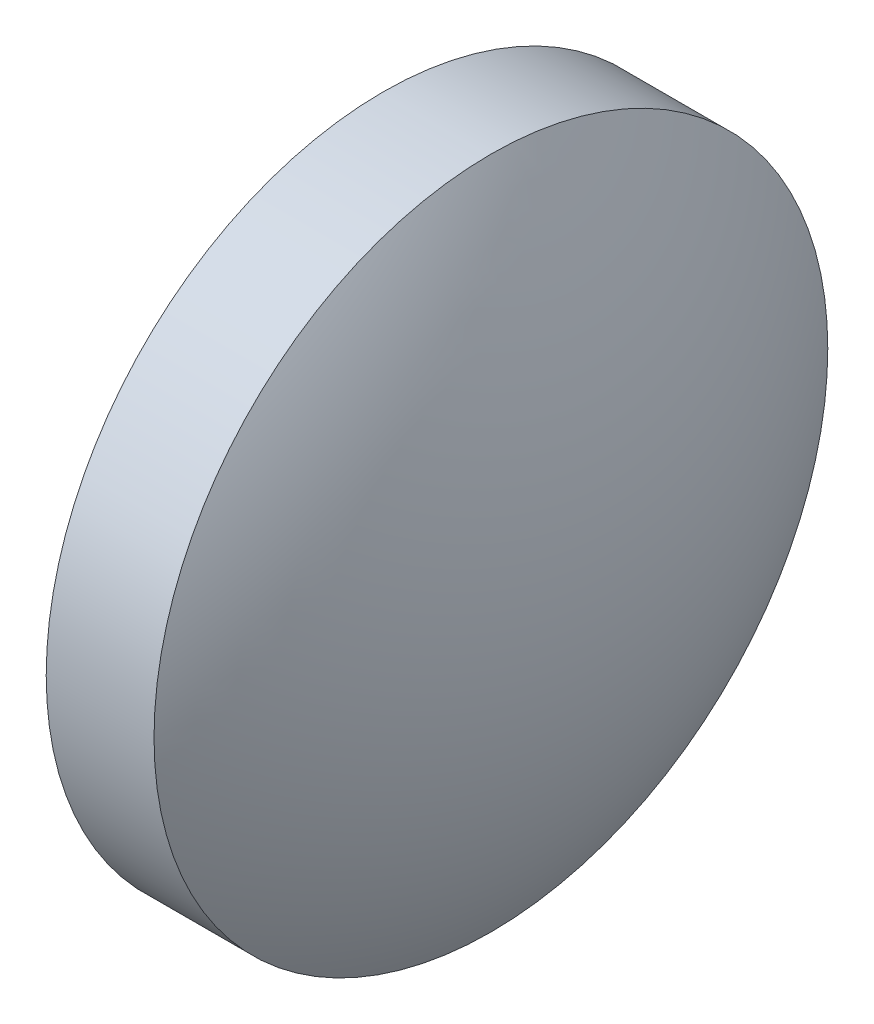
ISO-10303-21;
HEADER;
FILE_DESCRIPTION(('STEP AP214'),'2;1');
FILE_NAME('part.step','',(''),(''),'','','');
FILE_SCHEMA(('AUTOMOTIVE_DESIGN { 1 0 10303 214 1 1 1 1 }'));
ENDSEC;
DATA;
#1=APPLICATION_CONTEXT('core data for automotive mechanical design processes');
#2=APPLICATION_PROTOCOL_DEFINITION('international standard','automotive_design',2000,#1);
#3=PRODUCT_CONTEXT('',#1,'mechanical');
#4=PRODUCT('Part','Part','',(#3));
#5=PRODUCT_RELATED_PRODUCT_CATEGORY('part','',(#4));
#6=PRODUCT_DEFINITION_FORMATION('','',#4);
#7=PRODUCT_DEFINITION_CONTEXT('part definition',#1,'design');
#8=PRODUCT_DEFINITION('design','',#6,#7);
#9=PRODUCT_DEFINITION_SHAPE('','',#8);
#10=(LENGTH_UNIT() NAMED_UNIT(*) SI_UNIT(.MILLI.,.METRE.));
#11=(NAMED_UNIT(*) PLANE_ANGLE_UNIT() SI_UNIT($,.RADIAN.));
#12=(NAMED_UNIT(*) SI_UNIT($,.STERADIAN.) SOLID_ANGLE_UNIT());
#13=UNCERTAINTY_MEASURE_WITH_UNIT(LENGTH_MEASURE(1.E-05),#10,'distance_accuracy_value','');
#14=(GEOMETRIC_REPRESENTATION_CONTEXT(3) GLOBAL_UNCERTAINTY_ASSIGNED_CONTEXT((#13)) GLOBAL_UNIT_ASSIGNED_CONTEXT((#10,
#11,#12)) REPRESENTATION_CONTEXT('',''));
#15=CARTESIAN_POINT('',(0.,0.,0.));
#16=DIRECTION('',(0.,0.,1.));
#17=DIRECTION('',(1.,0.,0.));
#18=AXIS2_PLACEMENT_3D('',#15,#16,#17);
#19=CARTESIAN_POINT('',(51.6646010507235,23.9252524720398,0.));
#20=DIRECTION('',(-1.,0.,0.));
#21=DIRECTION('',(0.,1.,0.));
#22=AXIS2_PLACEMENT_3D('',#19,#20,#21);
#23=SPHERICAL_SURFACE('',#22,11.8912390975388);
#24=CARTESIAN_POINT('',(41.5483237080033,23.9252524720398,0.));
#25=DIRECTION('',(-1.,0.,0.));
#26=DIRECTION('',(0.,-1.,0.));
#27=AXIS2_PLACEMENT_3D('',#24,#25,#26);
#28=CIRCLE('',#27,6.25);
#29=CARTESIAN_POINT('',(41.5483237080033,17.6752524720398,0.));
#30=VERTEX_POINT('',#29);
#31=EDGE_CURVE('E41',#30,#30,#28,.T.);
#32=ORIENTED_EDGE('',*,*,#31,.T.);
#33=EDGE_LOOP('',(#32));
#34=FACE_BOUND('',#33,.T.);
#35=ADVANCED_FACE('F35',(#34),#23,.T.);
#36=CARTESIAN_POINT('',(33.4323025812427,23.9252524720398,0.));
#37=DIRECTION('',(-1.,0.,0.));
#38=DIRECTION('',(0.,1.,0.));
#39=AXIS2_PLACEMENT_3D('',#36,#37,#38);
#40=SPHERICAL_SURFACE('',#39,11.8910211267606);
#41=CARTESIAN_POINT('',(43.5483237080033,23.9252524720398,0.));
#42=DIRECTION('',(-1.,0.,0.));
#43=DIRECTION('',(0.,-1.,0.));
#44=AXIS2_PLACEMENT_3D('',#41,#42,#43);
#45=CIRCLE('',#44,6.25);
#46=CARTESIAN_POINT('',(43.5483237080032,17.6752524720398,0.));
#47=VERTEX_POINT('',#46);
#48=EDGE_CURVE('E10',#47,#47,#45,.T.);
#49=ORIENTED_EDGE('',*,*,#48,.F.);
#50=EDGE_LOOP('',(#49));
#51=FACE_BOUND('',#50,.T.);
#52=ADVANCED_FACE('F50',(#51),#40,.T.);
#53=CARTESIAN_POINT('',(36.0197470277065,23.9252524720398,0.));
#54=DIRECTION('',(-1.,0.,0.));
#55=DIRECTION('',(0.,-1.,0.));
#56=AXIS2_PLACEMENT_3D('',#53,#54,#55);
#57=CYLINDRICAL_SURFACE('',#56,6.25);
#58=ORIENTED_EDGE('',*,*,#48,.T.);
#59=EDGE_LOOP('',(#58));
#60=FACE_BOUND('',#59,.T.);
#61=ORIENTED_EDGE('',*,*,#31,.F.);
#62=EDGE_LOOP('',(#61));
#63=FACE_BOUND('',#62,.T.);
#64=ADVANCED_FACE('F48',(#60,#63),#57,.T.);
#65=CLOSED_SHELL('',(#35,#52,#64));
#66=MANIFOLD_SOLID_BREP('B2',#65);
#67=ADVANCED_BREP_SHAPE_REPRESENTATION('',(#18,#66),#14);
#68=SHAPE_DEFINITION_REPRESENTATION(#9,#67);
ENDSEC;
END-ISO-10303-21;
